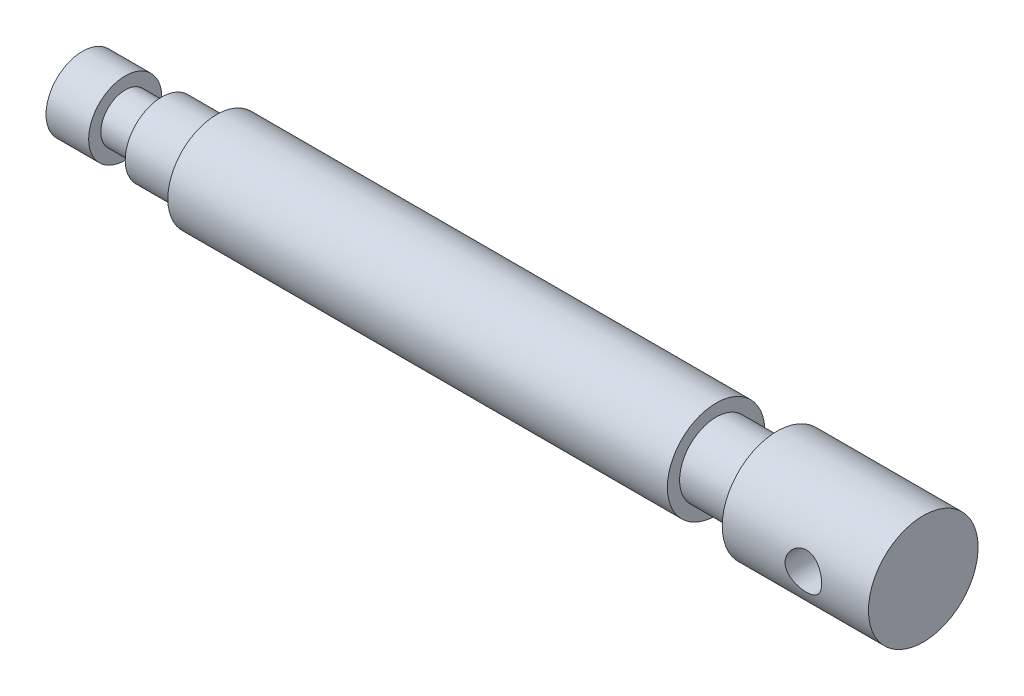
ISO-10303-21;
HEADER;
FILE_DESCRIPTION(('STEP AP214'),'2;1');
FILE_NAME('part.step','',(''),(''),'','','');
FILE_SCHEMA(('AUTOMOTIVE_DESIGN { 1 0 10303 214 1 1 1 1 }'));
ENDSEC;
DATA;
#1=APPLICATION_CONTEXT('core data for automotive mechanical design processes');
#2=APPLICATION_PROTOCOL_DEFINITION('international standard','automotive_design',2000,#1);
#3=PRODUCT_CONTEXT('',#1,'mechanical');
#4=PRODUCT('Part','Part','',(#3));
#5=PRODUCT_RELATED_PRODUCT_CATEGORY('part','',(#4));
#6=PRODUCT_DEFINITION_FORMATION('','',#4);
#7=PRODUCT_DEFINITION_CONTEXT('part definition',#1,'design');
#8=PRODUCT_DEFINITION('design','',#6,#7);
#9=PRODUCT_DEFINITION_SHAPE('','',#8);
#10=(LENGTH_UNIT() NAMED_UNIT(*) SI_UNIT(.MILLI.,.METRE.));
#11=(NAMED_UNIT(*) PLANE_ANGLE_UNIT() SI_UNIT($,.RADIAN.));
#12=(NAMED_UNIT(*) SI_UNIT($,.STERADIAN.) SOLID_ANGLE_UNIT());
#13=UNCERTAINTY_MEASURE_WITH_UNIT(LENGTH_MEASURE(1.E-05),#10,'distance_accuracy_value','');
#14=(GEOMETRIC_REPRESENTATION_CONTEXT(3) GLOBAL_UNCERTAINTY_ASSIGNED_CONTEXT((#13)) GLOBAL_UNIT_ASSIGNED_CONTEXT((#10,
#11,#12)) REPRESENTATION_CONTEXT('',''));
#15=CARTESIAN_POINT('',(0.,0.,0.));
#16=DIRECTION('',(0.,0.,1.));
#17=DIRECTION('',(1.,0.,0.));
#18=AXIS2_PLACEMENT_3D('',#15,#16,#17);
#19=CARTESIAN_POINT('',(22.,0.,0.));
#20=DIRECTION('',(-1.,0.,0.));
#21=DIRECTION('',(0.,0.,1.));
#22=AXIS2_PLACEMENT_3D('',#19,#20,#21);
#23=PLANE('',#22);
#24=CARTESIAN_POINT('',(22.,0.,0.));
#25=DIRECTION('',(-1.,0.,0.));
#26=DIRECTION('',(0.,0.,1.));
#27=AXIS2_PLACEMENT_3D('',#24,#25,#26);
#28=CIRCLE('',#27,8.);
#29=CARTESIAN_POINT('',(22.,0.,8.));
#30=VERTEX_POINT('',#29);
#31=EDGE_CURVE('E77',#30,#30,#28,.T.);
#32=ORIENTED_EDGE('',*,*,#31,.T.);
#33=EDGE_LOOP('',(#32));
#34=FACE_BOUND('',#33,.T.);
#35=CARTESIAN_POINT('',(22.,0.,0.));
#36=DIRECTION('',(-1.,0.,0.));
#37=DIRECTION('',(0.,0.,1.));
#38=AXIS2_PLACEMENT_3D('',#35,#36,#37);
#39=CIRCLE('',#38,6.);
#40=CARTESIAN_POINT('',(22.,0.,6.));
#41=VERTEX_POINT('',#40);
#42=EDGE_CURVE('E10',#41,#41,#39,.T.);
#43=ORIENTED_EDGE('',*,*,#42,.F.);
#44=EDGE_LOOP('',(#43));
#45=FACE_BOUND('',#44,.T.);
#46=ADVANCED_FACE('F33',(#34,#45),#23,.T.);
#47=CARTESIAN_POINT('',(-35.7429371115239,0.,0.));
#48=DIRECTION('',(-1.,0.,0.));
#49=DIRECTION('',(0.,0.,1.));
#50=AXIS2_PLACEMENT_3D('',#47,#48,#49);
#51=CYLINDRICAL_SURFACE('',#50,6.);
#52=ORIENTED_EDGE('',*,*,#42,.T.);
#53=EDGE_LOOP('',(#52));
#54=FACE_BOUND('',#53,.T.);
#55=CARTESIAN_POINT('',(13.,0.,0.));
#56=DIRECTION('',(-1.,0.,0.));
#57=DIRECTION('',(0.,0.,1.));
#58=AXIS2_PLACEMENT_3D('',#55,#56,#57);
#59=CIRCLE('',#58,6.);
#60=CARTESIAN_POINT('',(13.,0.,6.));
#61=VERTEX_POINT('',#60);
#62=EDGE_CURVE('E44',#61,#61,#59,.T.);
#63=ORIENTED_EDGE('',*,*,#62,.F.);
#64=EDGE_LOOP('',(#63));
#65=FACE_BOUND('',#64,.T.);
#66=ADVANCED_FACE('F122',(#54,#65),#51,.T.);
#67=CARTESIAN_POINT('',(13.,0.,0.));
#68=DIRECTION('',(1.,0.,0.));
#69=DIRECTION('',(0.,0.,-1.));
#70=AXIS2_PLACEMENT_3D('',#67,#68,#69);
#71=PLANE('',#70);
#72=CARTESIAN_POINT('',(13.,0.,0.));
#73=DIRECTION('',(-1.,0.,0.));
#74=DIRECTION('',(0.,0.,1.));
#75=AXIS2_PLACEMENT_3D('',#72,#73,#74);
#76=CIRCLE('',#75,4.);
#77=CARTESIAN_POINT('',(13.,0.,4.));
#78=VERTEX_POINT('',#77);
#79=EDGE_CURVE('E48',#78,#78,#76,.T.);
#80=ORIENTED_EDGE('',*,*,#79,.F.);
#81=EDGE_LOOP('',(#80));
#82=FACE_BOUND('',#81,.T.);
#83=ORIENTED_EDGE('',*,*,#62,.T.);
#84=EDGE_LOOP('',(#83));
#85=FACE_BOUND('',#84,.T.);
#86=ADVANCED_FACE('F127',(#82,#85),#71,.F.);
#87=CARTESIAN_POINT('',(-35.7429371115239,0.,0.));
#88=DIRECTION('',(-1.,0.,0.));
#89=DIRECTION('',(0.,0.,1.));
#90=AXIS2_PLACEMENT_3D('',#87,#88,#89);
#91=CYLINDRICAL_SURFACE('',#90,4.);
#92=ORIENTED_EDGE('',*,*,#79,.T.);
#93=EDGE_LOOP('',(#92));
#94=FACE_BOUND('',#93,.T.);
#95=CARTESIAN_POINT('',(7.,0.,0.));
#96=DIRECTION('',(-1.,0.,0.));
#97=DIRECTION('',(0.,0.,1.));
#98=AXIS2_PLACEMENT_3D('',#95,#96,#97);
#99=CIRCLE('',#98,4.);
#100=CARTESIAN_POINT('',(7.,0.,4.));
#101=VERTEX_POINT('',#100);
#102=EDGE_CURVE('E53',#101,#101,#99,.T.);
#103=ORIENTED_EDGE('',*,*,#102,.F.);
#104=EDGE_LOOP('',(#103));
#105=FACE_BOUND('',#104,.T.);
#106=ADVANCED_FACE('F134',(#94,#105),#91,.T.);
#107=CARTESIAN_POINT('',(7.,0.,0.));
#108=DIRECTION('',(1.,0.,0.));
#109=DIRECTION('',(0.,0.,-1.));
#110=AXIS2_PLACEMENT_3D('',#107,#108,#109);
#111=PLANE('',#110);
#112=ORIENTED_EDGE('',*,*,#102,.T.);
#113=EDGE_LOOP('',(#112));
#114=FACE_BOUND('',#113,.T.);
#115=CARTESIAN_POINT('',(7.,0.,0.));
#116=DIRECTION('',(-1.,0.,0.));
#117=DIRECTION('',(0.,0.,1.));
#118=AXIS2_PLACEMENT_3D('',#115,#116,#117);
#119=CIRCLE('',#118,6.);
#120=CARTESIAN_POINT('',(7.,0.,6.));
#121=VERTEX_POINT('',#120);
#122=EDGE_CURVE('E56',#121,#121,#119,.T.);
#123=ORIENTED_EDGE('',*,*,#122,.F.);
#124=EDGE_LOOP('',(#123));
#125=FACE_BOUND('',#124,.T.);
#126=ADVANCED_FACE('F141',(#114,#125),#111,.T.);
#127=CARTESIAN_POINT('',(-35.7429371115239,0.,0.));
#128=DIRECTION('',(-1.,0.,0.));
#129=DIRECTION('',(0.,0.,1.));
#130=AXIS2_PLACEMENT_3D('',#127,#128,#129);
#131=CYLINDRICAL_SURFACE('',#130,6.);
#132=ORIENTED_EDGE('',*,*,#122,.T.);
#133=EDGE_LOOP('',(#132));
#134=FACE_BOUND('',#133,.T.);
#135=CARTESIAN_POINT('',(0.,0.,0.));
#136=DIRECTION('',(-1.,0.,0.));
#137=DIRECTION('',(0.,0.,1.));
#138=AXIS2_PLACEMENT_3D('',#135,#136,#137);
#139=CIRCLE('',#138,6.);
#140=CARTESIAN_POINT('',(0.,0.,6.));
#141=VERTEX_POINT('',#140);
#142=EDGE_CURVE('E59',#141,#141,#139,.T.);
#143=ORIENTED_EDGE('',*,*,#142,.F.);
#144=EDGE_LOOP('',(#143));
#145=FACE_BOUND('',#144,.T.);
#146=ADVANCED_FACE('F145',(#134,#145),#131,.T.);
#147=CARTESIAN_POINT('',(0.,0.,0.));
#148=DIRECTION('',(-1.,0.,0.));
#149=DIRECTION('',(0.,0.,1.));
#150=AXIS2_PLACEMENT_3D('',#147,#148,#149);
#151=PLANE('',#150);
#152=ORIENTED_EDGE('',*,*,#142,.T.);
#153=EDGE_LOOP('',(#152));
#154=FACE_BOUND('',#153,.T.);
#155=ADVANCED_FACE('F149',(#154),#151,.T.);
#156=CARTESIAN_POINT('',(138.,0.,0.));
#157=DIRECTION('',(1.,0.,0.));
#158=DIRECTION('',(0.,0.,-1.));
#159=AXIS2_PLACEMENT_3D('',#156,#157,#158);
#160=PLANE('',#159);
#161=CARTESIAN_POINT('',(138.,0.,0.));
#162=DIRECTION('',(-1.,0.,0.));
#163=DIRECTION('',(0.,0.,1.));
#164=AXIS2_PLACEMENT_3D('',#161,#162,#163);
#165=CIRCLE('',#164,9.);
#166=CARTESIAN_POINT('',(138.,0.,9.));
#167=VERTEX_POINT('',#166);
#168=EDGE_CURVE('E62',#167,#167,#165,.T.);
#169=ORIENTED_EDGE('',*,*,#168,.F.);
#170=EDGE_LOOP('',(#169));
#171=FACE_BOUND('',#170,.T.);
#172=ADVANCED_FACE('F118',(#171),#160,.T.);
#173=CARTESIAN_POINT('',(-35.7429371115239,0.,0.));
#174=DIRECTION('',(-1.,0.,0.));
#175=DIRECTION('',(0.,0.,1.));
#176=AXIS2_PLACEMENT_3D('',#173,#174,#175);
#177=CYLINDRICAL_SURFACE('',#176,9.);
#178=CARTESIAN_POINT('',(130.319310505428,0.,-9.));
#179=CARTESIAN_POINT('',(130.319311266622,-0.163690088660168,-9.00000045902832));
#180=CARTESIAN_POINT('',(130.305869707046,-0.327375583615647,-8.99549308522634));
#181=CARTESIAN_POINT('',(130.252623178976,-0.649925282618914,-8.97795630609842));
#182=CARTESIAN_POINT('',(130.212815473581,-0.808788984356453,-8.96492601606458));
#183=CARTESIAN_POINT('',(130.108352775275,-1.11699836850533,-8.93175923719328));
#184=CARTESIAN_POINT('',(130.04373931805,-1.2663594776581,-8.9116346319256));
#185=CARTESIAN_POINT('',(129.891686986913,-1.55212481041598,-8.86633337152025));
#186=CARTESIAN_POINT('',(129.80424361042,-1.68852647087612,-8.84115572003334));
#187=CARTESIAN_POINT('',(129.605833090851,-1.9492250250668,-8.78742283329015));
#188=CARTESIAN_POINT('',(129.494216802646,-2.07301110089492,-8.75878669391355));
#189=CARTESIAN_POINT('',(129.252009041308,-2.30049807810624,-8.70180944349364));
#190=CARTESIAN_POINT('',(129.121413400642,-2.40419455646839,-8.67346839871647));
#191=CARTESIAN_POINT('',(128.840355159838,-2.59147482668358,-8.61939997431821));
#192=CARTESIAN_POINT('',(128.689429286231,-2.6743945746631,-8.59377117827064));
#193=CARTESIAN_POINT('',(128.374782222052,-2.81345662163316,-8.54925916255803));
#194=CARTESIAN_POINT('',(128.211064953939,-2.86960709216029,-8.53037388482237));
#195=CARTESIAN_POINT('',(127.881290840937,-2.95162038452748,-8.50233909808132));
#196=CARTESIAN_POINT('',(127.71549887996,-2.9784403448153,-8.49288287308834));
#197=CARTESIAN_POINT('',(127.38151924296,-3.00402337000343,-8.48386969888523));
#198=CARTESIAN_POINT('',(127.2133323233,-3.00279510481415,-8.4843096906819));
#199=CARTESIAN_POINT('',(126.887500614095,-2.97305971111025,-8.49477045024541));
#200=CARTESIAN_POINT('',(126.72972529667,-2.94580173950098,-8.50435247602599));
#201=CARTESIAN_POINT('',(126.421130246607,-2.86681848854825,-8.53129973173653));
#202=CARTESIAN_POINT('',(126.270311349122,-2.81509027977561,-8.54866589352323));
#203=CARTESIAN_POINT('',(125.977072256653,-2.68781717418063,-8.58953733393746));
#204=CARTESIAN_POINT('',(125.834826429019,-2.61190214612179,-8.61313697379352));
#205=CARTESIAN_POINT('',(125.564697780588,-2.43866731890942,-8.66377675727179));
#206=CARTESIAN_POINT('',(125.436819124627,-2.34134133709202,-8.6908178937139));
#207=CARTESIAN_POINT('',(125.192035710945,-2.12204799804673,-8.74701987503222));
#208=CARTESIAN_POINT('',(125.0760524219,-1.99905945022895,-8.77621768064528));
#209=CARTESIAN_POINT('',(124.866116705437,-1.7350187099102,-8.8322081516111));
#210=CARTESIAN_POINT('',(124.772166390934,-1.59396478698244,-8.85900058614202));
#211=CARTESIAN_POINT('',(124.608221604722,-1.2958428391388,-8.90751323813381));
#212=CARTESIAN_POINT('',(124.538474031405,-1.138629829249,-8.92918050024118));
#213=CARTESIAN_POINT('',(124.42670098356,-0.813807250093514,-8.96461701433304));
#214=CARTESIAN_POINT('',(124.384665879157,-0.646201314464852,-8.97838900964638));
#215=CARTESIAN_POINT('',(124.33114350736,-0.313151488587903,-8.99602881214321));
#216=CARTESIAN_POINT('',(124.318411077909,-0.14792879959453,-9.00030005501184));
#217=CARTESIAN_POINT('',(124.320308526223,0.182325209880719,-8.99966708084482));
#218=CARTESIAN_POINT('',(124.334933785367,0.347356557958958,-8.99476441258087));
#219=CARTESIAN_POINT('',(124.390146228635,0.667559598912774,-8.97660074151313));
#220=CARTESIAN_POINT('',(124.429969123576,0.822878420504539,-8.96358596133577));
#221=CARTESIAN_POINT('',(124.533490838828,1.12456787573873,-8.9307554049021));
#222=CARTESIAN_POINT('',(124.597192703831,1.27093736552582,-8.91093876140025));
#223=CARTESIAN_POINT('',(124.74852180095,1.55486488917982,-8.86586793861869));
#224=CARTESIAN_POINT('',(124.836734285277,1.69208987765145,-8.84048444267358));
#225=CARTESIAN_POINT('',(125.033892955468,1.95019449040677,-8.78715761748787));
#226=CARTESIAN_POINT('',(125.142845473523,2.07106910338673,-8.75921350781483));
#227=CARTESIAN_POINT('',(125.384246758447,2.2987575234189,-8.70230543941334));
#228=CARTESIAN_POINT('',(125.517538186208,2.40468290773731,-8.67335283262284));
#229=CARTESIAN_POINT('',(125.80062520886,2.59277256697072,-8.61899919884126));
#230=CARTESIAN_POINT('',(125.95042094133,2.67493664379304,-8.59359820146007));
#231=CARTESIAN_POINT('',(126.262329551297,2.81279079124908,-8.54947175374151));
#232=CARTESIAN_POINT('',(126.424416742934,2.86853439649506,-8.53073282378936));
#233=CARTESIAN_POINT('',(126.75644645556,2.95168400027806,-8.50232496919348));
#234=CARTESIAN_POINT('',(126.926385401641,2.97910276486182,-8.49265195870918));
#235=CARTESIAN_POINT('',(127.25990179355,3.00382884743202,-8.48393576622532));
#236=CARTESIAN_POINT('',(127.423357526288,3.00261077192519,-8.48437200772246));
#237=CARTESIAN_POINT('',(127.747605730194,2.97372688034607,-8.49453809471602));
#238=CARTESIAN_POINT('',(127.908398359293,2.94606263837575,-8.50426738708085));
#239=CARTESIAN_POINT('',(128.219717494435,2.86611543938802,-8.53153572914676));
#240=CARTESIAN_POINT('',(128.370380980441,2.81431003804652,-8.54892294067433));
#241=CARTESIAN_POINT('',(128.660992726242,2.68793809727922,-8.58949196455406));
#242=CARTESIAN_POINT('',(128.800938598992,2.6133665056614,-8.6126750629018));
#243=CARTESIAN_POINT('',(129.072761515196,2.43978207775028,-8.66348487678139));
#244=CARTESIAN_POINT('',(129.204020011123,2.33984472829373,-8.69126134926411));
#245=CARTESIAN_POINT('',(129.44837994558,2.11992864940694,-8.74750068849759));
#246=CARTESIAN_POINT('',(129.561476232492,1.99994425335444,-8.77596374737117));
#247=CARTESIAN_POINT('',(129.770743742295,1.73772467076206,-8.83170091576632));
#248=CARTESIAN_POINT('',(129.866083548681,1.59480454049917,-8.8588854540377));
#249=CARTESIAN_POINT('',(130.031281791979,1.29407207221985,-8.90777973517836));
#250=CARTESIAN_POINT('',(130.101146743194,1.13626355439702,-8.9294908772379));
#251=CARTESIAN_POINT('',(130.210475402894,0.81748094160291,-8.96416545205626));
#252=CARTESIAN_POINT('',(130.251157904218,0.656963273029212,-8.97747637267568));
#253=CARTESIAN_POINT('',(130.305571347459,0.330961248030734,-8.99539221192665));
#254=CARTESIAN_POINT('',(130.319309735917,0.165478276706236,-8.99999953595715));
#255=CARTESIAN_POINT('',(130.319310505428,0.,-9.));
#256=B_SPLINE_CURVE_WITH_KNOTS('',3,(#178,#179,#180,#181,#182,#183,#184,#185,#186,#187,#188,
#189,#190,#191,#192,#193,#194,#195,#196,#197,#198,#199,#200,#201,#202,#203,#204,#205,#206,#207,
#208,#209,#210,#211,#212,#213,#214,#215,#216,#217,#218,#219,#220,#221,#222,#223,#224,#225,#226,
#227,#228,#229,#230,#231,#232,#233,#234,#235,#236,#237,#238,#239,#240,#241,#242,#243,#244,#245,
#246,#247,#248,#249,#250,#251,#252,#253,#254,#255),.UNSPECIFIED.,.T.,.F.,(4,2,2,2,2,2,2,2,2,2,2,
2,2,2,2,2,2,2,2,2,2,2,2,2,2,2,2,2,2,2,2,2,2,2,2,2,2,2,4),(0.,0.490461318078029,
0.980973555802563,1.47066801861083,1.96045913339731,2.46554052848268,2.97073299862591,
3.49045154470411,4.01001134078499,4.51205777225523,5.01394901962457,5.49290479653841,
5.97191792566444,6.4586451346539,6.94551307674618,7.45779917434098,7.97013437899854,
8.48755216951072,9.00479006631624,9.49960749525508,9.99434139492528,10.4747447393464,
10.9552093585231,11.4483119953121,11.9415654246567,12.4572306864225,12.9729002470499,
13.4875204148031,14.0019085411752,14.4898699819277,14.9778023805413,15.4564676124125,
15.9352391452793,16.4349020007541,16.9347063337133,17.453989825053,17.9731404345737,
18.4690967512144,18.9649159811442),.UNSPECIFIED.);
#257=CARTESIAN_POINT('',(130.319310505428,0.,-9.));
#258=VERTEX_POINT('',#257);
#259=EDGE_CURVE('E80',#258,#258,#256,.T.);
#260=ORIENTED_EDGE('',*,*,#259,.F.);
#261=EDGE_LOOP('',(#260));
#262=FACE_BOUND('',#261,.T.);
#263=CARTESIAN_POINT('',(130.319310505428,0.,9.));
#264=CARTESIAN_POINT('',(130.319311266622,0.163690088660168,9.00000045902832));
#265=CARTESIAN_POINT('',(130.305869707046,0.327375583615647,8.99549308522634));
#266=CARTESIAN_POINT('',(130.252623178976,0.649925282618914,8.97795630609842));
#267=CARTESIAN_POINT('',(130.212815473581,0.808788984356453,8.96492601606458));
#268=CARTESIAN_POINT('',(130.108352775275,1.11699836850533,8.93175923719328));
#269=CARTESIAN_POINT('',(130.04373931805,1.2663594776581,8.9116346319256));
#270=CARTESIAN_POINT('',(129.891686986913,1.55212481041598,8.86633337152025));
#271=CARTESIAN_POINT('',(129.80424361042,1.68852647087612,8.84115572003334));
#272=CARTESIAN_POINT('',(129.605833090851,1.9492250250668,8.78742283329015));
#273=CARTESIAN_POINT('',(129.494216802646,2.07301110089492,8.75878669391355));
#274=CARTESIAN_POINT('',(129.252009041308,2.30049807810624,8.70180944349364));
#275=CARTESIAN_POINT('',(129.121413400642,2.40419455646839,8.67346839871647));
#276=CARTESIAN_POINT('',(128.840355159838,2.59147482668358,8.61939997431821));
#277=CARTESIAN_POINT('',(128.689429286231,2.6743945746631,8.59377117827064));
#278=CARTESIAN_POINT('',(128.374782222052,2.81345662163316,8.54925916255803));
#279=CARTESIAN_POINT('',(128.211064953939,2.86960709216029,8.53037388482237));
#280=CARTESIAN_POINT('',(127.881290840937,2.95162038452748,8.50233909808132));
#281=CARTESIAN_POINT('',(127.71549887996,2.9784403448153,8.49288287308834));
#282=CARTESIAN_POINT('',(127.38151924296,3.00402337000343,8.48386969888523));
#283=CARTESIAN_POINT('',(127.2133323233,3.00279510481415,8.4843096906819));
#284=CARTESIAN_POINT('',(126.887500614095,2.97305971111025,8.49477045024541));
#285=CARTESIAN_POINT('',(126.72972529667,2.94580173950098,8.50435247602599));
#286=CARTESIAN_POINT('',(126.421130246607,2.86681848854825,8.53129973173653));
#287=CARTESIAN_POINT('',(126.270311349122,2.81509027977561,8.54866589352323));
#288=CARTESIAN_POINT('',(125.977072256653,2.68781717418063,8.58953733393746));
#289=CARTESIAN_POINT('',(125.834826429019,2.61190214612179,8.61313697379352));
#290=CARTESIAN_POINT('',(125.564697780588,2.43866731890942,8.66377675727179));
#291=CARTESIAN_POINT('',(125.436819124627,2.34134133709202,8.6908178937139));
#292=CARTESIAN_POINT('',(125.192035710945,2.12204799804673,8.74701987503222));
#293=CARTESIAN_POINT('',(125.0760524219,1.99905945022895,8.77621768064528));
#294=CARTESIAN_POINT('',(124.866116705437,1.7350187099102,8.8322081516111));
#295=CARTESIAN_POINT('',(124.772166390934,1.59396478698244,8.85900058614202));
#296=CARTESIAN_POINT('',(124.608221604722,1.2958428391388,8.90751323813381));
#297=CARTESIAN_POINT('',(124.538474031405,1.138629829249,8.92918050024118));
#298=CARTESIAN_POINT('',(124.42670098356,0.813807250093514,8.96461701433304));
#299=CARTESIAN_POINT('',(124.384665879157,0.646201314464852,8.97838900964638));
#300=CARTESIAN_POINT('',(124.33114350736,0.313151488587903,8.99602881214321));
#301=CARTESIAN_POINT('',(124.318411077909,0.14792879959453,9.00030005501184));
#302=CARTESIAN_POINT('',(124.320308526223,-0.182325209880719,8.99966708084482));
#303=CARTESIAN_POINT('',(124.334933785367,-0.347356557958958,8.99476441258087));
#304=CARTESIAN_POINT('',(124.390146228635,-0.667559598912774,8.97660074151313));
#305=CARTESIAN_POINT('',(124.429969123576,-0.822878420504539,8.96358596133577));
#306=CARTESIAN_POINT('',(124.533490838828,-1.12456787573873,8.9307554049021));
#307=CARTESIAN_POINT('',(124.597192703831,-1.27093736552582,8.91093876140025));
#308=CARTESIAN_POINT('',(124.74852180095,-1.55486488917982,8.86586793861869));
#309=CARTESIAN_POINT('',(124.836734285277,-1.69208987765145,8.84048444267358));
#310=CARTESIAN_POINT('',(125.033892955468,-1.95019449040677,8.78715761748787));
#311=CARTESIAN_POINT('',(125.142845473523,-2.07106910338673,8.75921350781483));
#312=CARTESIAN_POINT('',(125.384246758447,-2.2987575234189,8.70230543941334));
#313=CARTESIAN_POINT('',(125.517538186208,-2.40468290773731,8.67335283262284));
#314=CARTESIAN_POINT('',(125.80062520886,-2.59277256697072,8.61899919884126));
#315=CARTESIAN_POINT('',(125.95042094133,-2.67493664379304,8.59359820146007));
#316=CARTESIAN_POINT('',(126.262329551297,-2.81279079124908,8.54947175374151));
#317=CARTESIAN_POINT('',(126.424416742934,-2.86853439649506,8.53073282378936));
#318=CARTESIAN_POINT('',(126.75644645556,-2.95168400027806,8.50232496919348));
#319=CARTESIAN_POINT('',(126.926385401641,-2.97910276486182,8.49265195870918));
#320=CARTESIAN_POINT('',(127.25990179355,-3.00382884743202,8.48393576622532));
#321=CARTESIAN_POINT('',(127.423357526288,-3.00261077192519,8.48437200772246));
#322=CARTESIAN_POINT('',(127.747605730194,-2.97372688034607,8.49453809471602));
#323=CARTESIAN_POINT('',(127.908398359293,-2.94606263837575,8.50426738708085));
#324=CARTESIAN_POINT('',(128.219717494435,-2.86611543938802,8.53153572914676));
#325=CARTESIAN_POINT('',(128.370380980441,-2.81431003804652,8.54892294067433));
#326=CARTESIAN_POINT('',(128.660992726242,-2.68793809727922,8.58949196455406));
#327=CARTESIAN_POINT('',(128.800938598992,-2.6133665056614,8.6126750629018));
#328=CARTESIAN_POINT('',(129.072761515196,-2.43978207775028,8.66348487678139));
#329=CARTESIAN_POINT('',(129.204020011123,-2.33984472829373,8.69126134926411));
#330=CARTESIAN_POINT('',(129.44837994558,-2.11992864940694,8.74750068849759));
#331=CARTESIAN_POINT('',(129.561476232492,-1.99994425335444,8.77596374737117));
#332=CARTESIAN_POINT('',(129.770743742295,-1.73772467076206,8.83170091576632));
#333=CARTESIAN_POINT('',(129.866083548681,-1.59480454049917,8.8588854540377));
#334=CARTESIAN_POINT('',(130.031281791979,-1.29407207221985,8.90777973517836));
#335=CARTESIAN_POINT('',(130.101146743194,-1.13626355439702,8.9294908772379));
#336=CARTESIAN_POINT('',(130.210475402894,-0.81748094160291,8.96416545205626));
#337=CARTESIAN_POINT('',(130.251157904218,-0.656963273029212,8.97747637267568));
#338=CARTESIAN_POINT('',(130.305571347459,-0.330961248030734,8.99539221192665));
#339=CARTESIAN_POINT('',(130.319309735917,-0.165478276706236,8.99999953595715));
#340=CARTESIAN_POINT('',(130.319310505428,0.,9.));
#341=B_SPLINE_CURVE_WITH_KNOTS('',3,(#263,#264,#265,#266,#267,#268,#269,#270,#271,#272,#273,
#274,#275,#276,#277,#278,#279,#280,#281,#282,#283,#284,#285,#286,#287,#288,#289,#290,#291,#292,
#293,#294,#295,#296,#297,#298,#299,#300,#301,#302,#303,#304,#305,#306,#307,#308,#309,#310,#311,
#312,#313,#314,#315,#316,#317,#318,#319,#320,#321,#322,#323,#324,#325,#326,#327,#328,#329,#330,
#331,#332,#333,#334,#335,#336,#337,#338,#339,#340),.UNSPECIFIED.,.T.,.F.,(4,2,2,2,2,2,2,2,2,2,2,
2,2,2,2,2,2,2,2,2,2,2,2,2,2,2,2,2,2,2,2,2,2,2,2,2,2,2,4),(0.,0.490461318078029,
0.980973555802563,1.47066801861083,1.96045913339731,2.46554052848268,2.97073299862591,
3.49045154470411,4.01001134078499,4.51205777225523,5.01394901962457,5.49290479653841,
5.97191792566444,6.4586451346539,6.94551307674618,7.45779917434098,7.97013437899854,
8.48755216951072,9.00479006631624,9.49960749525508,9.99434139492528,10.4747447393464,
10.9552093585231,11.4483119953121,11.9415654246567,12.4572306864225,12.9729002470499,
13.4875204148031,14.0019085411752,14.4898699819277,14.9778023805413,15.4564676124125,
15.9352391452793,16.4349020007541,16.9347063337133,17.453989825053,17.9731404345737,
18.4690967512144,18.9649159811442),.UNSPECIFIED.);
#342=CARTESIAN_POINT('',(130.319310505428,0.,9.));
#343=VERTEX_POINT('',#342);
#344=EDGE_CURVE('E86',#343,#343,#341,.T.);
#345=ORIENTED_EDGE('',*,*,#344,.F.);
#346=EDGE_LOOP('',(#345));
#347=FACE_BOUND('',#346,.T.);
#348=ORIENTED_EDGE('',*,*,#168,.T.);
#349=EDGE_LOOP('',(#348));
#350=FACE_BOUND('',#349,.T.);
#351=CARTESIAN_POINT('',(114.,0.,0.));
#352=DIRECTION('',(-1.,0.,0.));
#353=DIRECTION('',(0.,0.,1.));
#354=AXIS2_PLACEMENT_3D('',#351,#352,#353);
#355=CIRCLE('',#354,9.);
#356=CARTESIAN_POINT('',(114.,0.,9.));
#357=VERTEX_POINT('',#356);
#358=EDGE_CURVE('E65',#357,#357,#355,.T.);
#359=ORIENTED_EDGE('',*,*,#358,.F.);
#360=EDGE_LOOP('',(#359));
#361=FACE_BOUND('',#360,.T.);
#362=ADVANCED_FACE('F89',(#262,#347,#350,#361),#177,.T.);
#363=CARTESIAN_POINT('',(114.,-5.27355936696949E-13,0.));
#364=DIRECTION('',(-1.,0.,0.));
#365=DIRECTION('',(0.,0.,1.));
#366=AXIS2_PLACEMENT_3D('',#363,#364,#365);
#367=PLANE('',#366);
#368=ORIENTED_EDGE('',*,*,#358,.T.);
#369=EDGE_LOOP('',(#368));
#370=FACE_BOUND('',#369,.T.);
#371=CARTESIAN_POINT('',(114.,0.,0.));
#372=DIRECTION('',(-1.,0.,0.));
#373=DIRECTION('',(0.,0.,1.));
#374=AXIS2_PLACEMENT_3D('',#371,#372,#373);
#375=CIRCLE('',#374,6.);
#376=CARTESIAN_POINT('',(114.,0.,6.));
#377=VERTEX_POINT('',#376);
#378=EDGE_CURVE('E68',#377,#377,#375,.T.);
#379=ORIENTED_EDGE('',*,*,#378,.F.);
#380=EDGE_LOOP('',(#379));
#381=FACE_BOUND('',#380,.T.);
#382=ADVANCED_FACE('F111',(#370,#381),#367,.T.);
#383=CARTESIAN_POINT('',(-35.7429371115239,0.,0.));
#384=DIRECTION('',(-1.,0.,0.));
#385=DIRECTION('',(0.,0.,1.));
#386=AXIS2_PLACEMENT_3D('',#383,#384,#385);
#387=CYLINDRICAL_SURFACE('',#386,6.);
#388=ORIENTED_EDGE('',*,*,#378,.T.);
#389=EDGE_LOOP('',(#388));
#390=FACE_BOUND('',#389,.T.);
#391=CARTESIAN_POINT('',(104.,0.,0.));
#392=DIRECTION('',(-1.,0.,0.));
#393=DIRECTION('',(0.,0.,1.));
#394=AXIS2_PLACEMENT_3D('',#391,#392,#393);
#395=CIRCLE('',#394,6.);
#396=CARTESIAN_POINT('',(104.,0.,6.));
#397=VERTEX_POINT('',#396);
#398=EDGE_CURVE('E71',#397,#397,#395,.T.);
#399=ORIENTED_EDGE('',*,*,#398,.F.);
#400=EDGE_LOOP('',(#399));
#401=FACE_BOUND('',#400,.T.);
#402=ADVANCED_FACE('F108',(#390,#401),#387,.T.);
#403=CARTESIAN_POINT('',(104.,-4.81096644004234E-13,0.));
#404=DIRECTION('',(1.,0.,0.));
#405=DIRECTION('',(0.,0.,-1.));
#406=AXIS2_PLACEMENT_3D('',#403,#404,#405);
#407=PLANE('',#406);
#408=ORIENTED_EDGE('',*,*,#398,.T.);
#409=EDGE_LOOP('',(#408));
#410=FACE_BOUND('',#409,.T.);
#411=CARTESIAN_POINT('',(104.,0.,0.));
#412=DIRECTION('',(-1.,0.,0.));
#413=DIRECTION('',(0.,0.,1.));
#414=AXIS2_PLACEMENT_3D('',#411,#412,#413);
#415=CIRCLE('',#414,8.);
#416=CARTESIAN_POINT('',(104.,0.,8.));
#417=VERTEX_POINT('',#416);
#418=EDGE_CURVE('E74',#417,#417,#415,.T.);
#419=ORIENTED_EDGE('',*,*,#418,.F.);
#420=EDGE_LOOP('',(#419));
#421=FACE_BOUND('',#420,.T.);
#422=ADVANCED_FACE('F104',(#410,#421),#407,.T.);
#423=CARTESIAN_POINT('',(-35.7429371115239,0.,0.));
#424=DIRECTION('',(-1.,0.,0.));
#425=DIRECTION('',(0.,0.,1.));
#426=AXIS2_PLACEMENT_3D('',#423,#424,#425);
#427=CYLINDRICAL_SURFACE('',#426,8.);
#428=ORIENTED_EDGE('',*,*,#418,.T.);
#429=EDGE_LOOP('',(#428));
#430=FACE_BOUND('',#429,.T.);
#431=ORIENTED_EDGE('',*,*,#31,.F.);
#432=EDGE_LOOP('',(#431));
#433=FACE_BOUND('',#432,.T.);
#434=ADVANCED_FACE('F98',(#430,#433),#427,.T.);
#435=CARTESIAN_POINT('',(127.319310505428,0.,-9.));
#436=DIRECTION('',(0.,0.,1.));
#437=DIRECTION('',(1.,0.,0.));
#438=AXIS2_PLACEMENT_3D('',#435,#436,#437);
#439=CYLINDRICAL_SURFACE('',#438,2.99999999999999);
#440=ORIENTED_EDGE('',*,*,#259,.T.);
#441=EDGE_LOOP('',(#440));
#442=FACE_BOUND('',#441,.T.);
#443=ORIENTED_EDGE('',*,*,#344,.T.);
#444=EDGE_LOOP('',(#443));
#445=FACE_BOUND('',#444,.T.);
#446=CARTESIAN_POINT('',(126.659655252714,2.9265773435136,0.));
#447=CARTESIAN_POINT('',(126.659650837131,2.92657750619089,0.0795740052714432));
#448=CARTESIAN_POINT('',(126.652366137299,2.92496293225891,0.159161563243745));
#449=CARTESIAN_POINT('',(126.624204271875,2.91839381906894,0.315759379057495));
#450=CARTESIAN_POINT('',(126.603310062852,2.91343509159145,0.392766277779108));
#451=CARTESIAN_POINT('',(126.5436585538,2.89819239038064,0.561090149823607));
#452=CARTESIAN_POINT('',(126.501742997985,2.88688765049301,0.651177017635139));
#453=CARTESIAN_POINT('',(126.405540859001,2.85789011586046,0.823395651046476));
#454=CARTESIAN_POINT('',(126.351225506179,2.84018240844958,0.905508273362158));
#455=CARTESIAN_POINT('',(126.250353231745,2.80346230871164,1.04079347185785));
#456=CARTESIAN_POINT('',(126.205629040365,2.78607689004311,1.09581665841293));
#457=CARTESIAN_POINT('',(126.113249866692,2.74734850206025,1.20190388061237));
#458=CARTESIAN_POINT('',(126.065593597614,2.72600378674844,1.25296615540328));
#459=CARTESIAN_POINT('',(125.968469423281,2.67920459765607,1.3513690828977));
#460=CARTESIAN_POINT('',(125.919000847281,2.65374859013421,1.3987083368686));
#461=CARTESIAN_POINT('',(125.819171129211,2.59862186527097,1.48989871303789));
#462=CARTESIAN_POINT('',(125.768809640188,2.56894947672523,1.53374844132534));
#463=CARTESIAN_POINT('',(125.666248493663,2.50423384679792,1.6196081767878));
#464=CARTESIAN_POINT('',(125.614045867568,2.46903961457676,1.66150102887094));
#465=CARTESIAN_POINT('',(125.510317962206,2.39408658893043,1.74191855033156));
#466=CARTESIAN_POINT('',(125.458792897929,2.35432638390494,1.78044217157003));
#467=CARTESIAN_POINT('',(125.306346787047,2.22829587096919,1.89111788146274));
#468=CARTESIAN_POINT('',(125.20744180751,2.13520616955392,1.9584662859441));
#469=CARTESIAN_POINT('',(125.009330757083,1.9203466528864,2.08787673736061));
#470=CARTESIAN_POINT('',(124.911384034635,1.79651433337948,2.14845317924184));
#471=CARTESIAN_POINT('',(124.734079866945,1.53040347148289,2.25470224369754));
#472=CARTESIAN_POINT('',(124.65472384568,1.38812351737015,2.30037372471374));
#473=CARTESIAN_POINT('',(124.522586914177,1.09666125009547,2.37491654918855));
#474=CARTESIAN_POINT('',(124.468680234903,0.948174558165798,2.40451070458336));
#475=CARTESIAN_POINT('',(124.384674888249,0.642642409389242,2.45017027451081));
#476=CARTESIAN_POINT('',(124.354567625214,0.485600064519365,2.46624057360088));
#477=CARTESIAN_POINT('',(124.320667895069,0.176292495705924,2.48430568990167));
#478=CARTESIAN_POINT('',(124.315578780406,0.02420836288608,2.4869941616631));
#479=CARTESIAN_POINT('',(124.328441443394,-0.278690988807912,2.4801617990009));
#480=CARTESIAN_POINT('',(124.346389771228,-0.429506394267924,2.47064279262603));
#481=CARTESIAN_POINT('',(124.403980682373,-0.723104094344425,2.43969350426885));
#482=CARTESIAN_POINT('',(124.443270755858,-0.865976426004544,2.41845668223857));
#483=CARTESIAN_POINT('',(124.541477646862,-1.14243701022336,2.36427614263318));
#484=CARTESIAN_POINT('',(124.600395444427,-1.27602479878687,2.3313318404788));
#485=CARTESIAN_POINT('',(124.736674843048,-1.53352515843477,2.25290705533736));
#486=CARTESIAN_POINT('',(124.814423241494,-1.65715077827581,2.20716003909416));
#487=CARTESIAN_POINT('',(124.984005892116,-1.8886273565286,2.10335537454299));
#488=CARTESIAN_POINT('',(125.075842903759,-1.9964752165263,2.04529531368593));
#489=CARTESIAN_POINT('',(125.223341455819,-2.14761761262627,1.94705679180264));
#490=CARTESIAN_POINT('',(125.275588674004,-2.19733289861273,1.91139450267203));
#491=CARTESIAN_POINT('',(125.38201844921,-2.29171248238627,1.8364652783423));
#492=CARTESIAN_POINT('',(125.436200472176,-2.33637816002848,1.79719933321715));
#493=CARTESIAN_POINT('',(125.545748956566,-2.42059072239039,1.71489692045495));
#494=CARTESIAN_POINT('',(125.601116300817,-2.46013362533522,1.67185756291162));
#495=CARTESIAN_POINT('',(125.712107475021,-2.53403629872841,1.58184881442115));
#496=CARTESIAN_POINT('',(125.767731265867,-2.56839683416634,1.53488000511027));
#497=CARTESIAN_POINT('',(125.870588394217,-2.62758899299171,1.44354940088386));
#498=CARTESIAN_POINT('',(125.917919064394,-2.65308125124345,1.39972417097758));
#499=CARTESIAN_POINT('',(126.011265584378,-2.70032463665794,1.30878659842942));
#500=CARTESIAN_POINT('',(126.057281661509,-2.72207641393907,1.26167482901306));
#501=CARTESIAN_POINT('',(126.147063182603,-2.76192755689663,1.16400933112188));
#502=CARTESIAN_POINT('',(126.19083166505,-2.7800319557247,1.11346047632979));
#503=CARTESIAN_POINT('',(126.275099448453,-2.81276864942132,1.00868221224809));
#504=CARTESIAN_POINT('',(126.315600349486,-2.8274026505744,0.954454628610306));
#505=CARTESIAN_POINT('',(126.403466841711,-2.85726555787262,0.825407588277908));
#506=CARTESIAN_POINT('',(126.449297366706,-2.87137967135401,0.749256608726367));
#507=CARTESIAN_POINT('',(126.529839605949,-2.89456454268129,0.590585983151744));
#508=CARTESIAN_POINT('',(126.564570763947,-2.90364414068191,0.508077791926122));
#509=CARTESIAN_POINT('',(126.614732914395,-2.91618493374985,0.351597189138895));
#510=CARTESIAN_POINT('',(126.632375271887,-2.92031676930352,0.278398820245273));
#511=CARTESIAN_POINT('',(126.655331065209,-2.92562451755224,0.129991767318623));
#512=CARTESIAN_POINT('',(126.660654899628,-2.92680292343275,0.0547848330956989));
#513=CARTESIAN_POINT('',(126.658341724878,-2.92628100530175,-0.0954841217227632));
#514=CARTESIAN_POINT('',(126.650692694071,-2.92457801117068,-0.170545943304118));
#515=CARTESIAN_POINT('',(126.623333491537,-2.91818511475785,-0.318306131132616));
#516=CARTESIAN_POINT('',(126.603611885066,-2.91349238052124,-0.391002187773073));
#517=CARTESIAN_POINT('',(126.546396588128,-2.89891588716947,-0.554476909210777));
#518=CARTESIAN_POINT('',(126.505288200434,-2.88787363617403,-0.643872180841377));
#519=CARTESIAN_POINT('',(126.410786305947,-2.85954608563299,-0.814885576976066));
#520=CARTESIAN_POINT('',(126.357362271684,-2.84224521080264,-0.896483651141028));
#521=CARTESIAN_POINT('',(126.257850626631,-2.80630079267834,-1.03124152929134));
#522=CARTESIAN_POINT('',(126.213577861299,-2.78923166474451,-1.08620209532773));
#523=CARTESIAN_POINT('',(126.122059462348,-2.75118945053121,-1.19219239535704));
#524=CARTESIAN_POINT('',(126.074812495776,-2.73021460545438,-1.24322034374423));
#525=CARTESIAN_POINT('',(125.978459498152,-2.68420784413489,-1.34157977111586));
#526=CARTESIAN_POINT('',(125.929352749285,-2.65917434890181,-1.38890980078714));
#527=CARTESIAN_POINT('',(125.830195656373,-2.60494389974611,-1.48010433275671));
#528=CARTESIAN_POINT('',(125.78014494381,-2.57574528932107,-1.5239674453937));
#529=CARTESIAN_POINT('',(125.678121585327,-2.51201940896988,-1.60990902636064));
#530=CARTESIAN_POINT('',(125.626143889201,-2.47733956613417,-1.65186855544678));
#531=CARTESIAN_POINT('',(125.522802195463,-2.40345636438562,-1.7324391024959));
#532=CARTESIAN_POINT('',(125.47143839212,-2.36425161329343,-1.7710490834684));
#533=CARTESIAN_POINT('',(125.31937450887,-2.23994186361332,-1.882014902663));
#534=CARTESIAN_POINT('',(125.220589923279,-2.14807318863763,-1.94959785424794));
#535=CARTESIAN_POINT('',(125.02188831559,-1.93533252492033,-2.07994829792496));
#536=CARTESIAN_POINT('',(124.923256345279,-1.81230352671738,-2.14116618832552));
#537=CARTESIAN_POINT('',(124.744375630605,-1.54764706997679,-2.24868476416955));
#538=CARTESIAN_POINT('',(124.664128612457,-1.40601786697553,-2.29498404902846));
#539=CARTESIAN_POINT('',(124.530032173822,-1.11547277688872,-2.3707867798115));
#540=CARTESIAN_POINT('',(124.475087607396,-0.967247542954748,-2.40099831205395));
#541=CARTESIAN_POINT('',(124.388976944573,-0.662015394372773,-2.4478583739081));
#542=CARTESIAN_POINT('',(124.35780218811,-0.505011700383473,-2.4645118432856));
#543=CARTESIAN_POINT('',(124.321864638188,-0.195655838270231,-2.48367199294107));
#544=CARTESIAN_POINT('',(124.315789698359,-0.0434981015389665,-2.48688161033729));
#545=CARTESIAN_POINT('',(124.32672911033,0.259734972319729,-2.48107185849107));
#546=CARTESIAN_POINT('',(124.343739904928,0.410810472599675,-2.47205437328132));
#547=CARTESIAN_POINT('',(124.399539847364,0.704966241867517,-2.4420907103859));
#548=CARTESIAN_POINT('',(124.437956707422,0.848138400718023,-2.42134836112432));
#549=CARTESIAN_POINT('',(124.534505849932,1.12534795091587,-2.36815773591158));
#550=CARTESIAN_POINT('',(124.592639071693,1.2593849066871,-2.33570890224652));
#551=CARTESIAN_POINT('',(124.727423023218,1.51783327483302,-2.25830922380704));
#552=CARTESIAN_POINT('',(124.80445051204,1.64197046828335,-2.2131007673705));
#553=CARTESIAN_POINT('',(124.972682194076,1.87455217010874,-2.11043129932062));
#554=CARTESIAN_POINT('',(125.063888989712,1.98299379070251,-2.0529680377808));
#555=CARTESIAN_POINT('',(125.261275838938,2.18763547874703,-1.92205950040066));
#556=CARTESIAN_POINT('',(125.367994999158,2.28287436364267,-1.84792536626425));
#557=CARTESIAN_POINT('',(125.586427081513,2.45280702724626,-1.6847915203777));
#558=CARTESIAN_POINT('',(125.698142909865,2.5274886637288,-1.59578307271377));
#559=CARTESIAN_POINT('',(125.904904175399,2.64798901369169,-1.41375056509902));
#560=CARTESIAN_POINT('',(126.000243659033,2.69628618362574,-1.32271986428699));
#561=CARTESIAN_POINT('',(126.136735024188,2.75754013440221,-1.17565815098668));
#562=CARTESIAN_POINT('',(126.181130348618,2.77608793852357,-1.12490605095799));
#563=CARTESIAN_POINT('',(126.266676163708,2.80963778338709,-1.01965392587335));
#564=CARTESIAN_POINT('',(126.307828264943,2.82464159155393,-0.965155786584774));
#565=CARTESIAN_POINT('',(126.396965790307,2.85518707769803,-0.835739609120725));
#566=CARTESIAN_POINT('',(126.443450012001,2.86961239377377,-0.759497572615622));
#567=CARTESIAN_POINT('',(126.525345011973,2.89334527842346,-0.60055946446721));
#568=CARTESIAN_POINT('',(126.560776045814,2.9026622323758,-0.517875549726484));
#569=CARTESIAN_POINT('',(126.611566601588,2.9154175701501,-0.362939740164006));
#570=CARTESIAN_POINT('',(126.629424541989,2.91962385425905,-0.291581471970276));
#571=CARTESIAN_POINT('',(126.653466503266,2.92520259747913,-0.146818257362255));
#572=CARTESIAN_POINT('',(126.659659326526,2.92657719342769,-0.0734148966353297));
#573=CARTESIAN_POINT('',(126.659655252714,2.9265773435136,0.));
#574=B_SPLINE_CURVE_WITH_KNOTS('',3,(#446,#447,#448,#449,#450,#451,#452,#453,#454,#455,#456,
#457,#458,#459,#460,#461,#462,#463,#464,#465,#466,#467,#468,#469,#470,#471,#472,#473,#474,#475,
#476,#477,#478,#479,#480,#481,#482,#483,#484,#485,#486,#487,#488,#489,#490,#491,#492,#493,#494,
#495,#496,#497,#498,#499,#500,#501,#502,#503,#504,#505,#506,#507,#508,#509,#510,#511,#512,#513,
#514,#515,#516,#517,#518,#519,#520,#521,#522,#523,#524,#525,#526,#527,#528,#529,#530,#531,#532,
#533,#534,#535,#536,#537,#538,#539,#540,#541,#542,#543,#544,#545,#546,#547,#548,#549,#550,#551,
#552,#553,#554,#555,#556,#557,#558,#559,#560,#561,#562,#563,#564,#565,#566,#567,#568,#569,#570,
#571,#572,#573),.UNSPECIFIED.,.T.,.F.,(4,2,2,2,2,2,2,2,2,2,2,2,2,2,2,2,2,2,2,2,2,2,2,2,2,2,2,2,
2,2,2,2,2,2,2,2,2,2,2,2,2,2,2,2,2,2,2,2,2,2,2,2,2,2,2,2,2,2,2,2,2,2,2,4),(0.,0.23842073046933,
0.477140615060968,0.775488069089534,1.07453490500069,1.29328552811696,1.51213284769727,
1.73106199892081,1.95007816818856,2.17671739949951,2.40342688740147,2.85636736181793,
3.36111181477043,3.86589491660348,4.34556321132625,4.82505818461733,5.27941893443318,
5.73371165245567,6.180719224889,6.62774912049388,7.08488359946036,7.54210772968852,
7.78325691543308,8.0243400446952,8.2656094503054,8.50684320626311,8.71474343712997,
8.92260749706836,9.13018272282999,9.33765567785191,9.60676420988612,9.87539870302636,
10.1006402468038,10.325691585145,10.5509515870342,10.7764252785778,11.071820123894,
11.3679552072487,11.5855116083183,11.8031662159473,12.0209057047222,12.2387320330737,
12.4643047893099,12.6899471334992,13.1407573908428,13.6456338410874,14.1505576762084,
14.6308943295998,15.1110558979662,15.565771350573,16.0204167455823,16.4673913423853,
16.9143872365195,17.3711473504141,17.8279913956928,18.3091974547514,18.7906871332735,
19.2101690193007,19.4197522304837,19.6292306987882,19.89972730523,20.1697252599798,
20.3898581611012,20.6098248854532),.UNSPECIFIED.);
#575=CARTESIAN_POINT('',(126.659655252714,2.9265773435136,0.));
#576=VERTEX_POINT('',#575);
#577=EDGE_CURVE('E36',#576,#576,#574,.T.);
#578=ORIENTED_EDGE('',*,*,#577,.F.);
#579=EDGE_LOOP('',(#578));
#580=FACE_BOUND('',#579,.T.);
#581=ADVANCED_FACE('F93',(#442,#445,#580),#439,.F.);
#582=CARTESIAN_POINT('',(126.,0.,0.));
#583=DIRECTION('',(-1.,0.,0.));
#584=DIRECTION('',(0.,1.,0.));
#585=AXIS2_PLACEMENT_3D('',#582,#583,#584);
#586=SPHERICAL_SURFACE('',#585,3.);
#587=ORIENTED_EDGE('',*,*,#577,.T.);
#588=EDGE_LOOP('',(#587));
#589=FACE_BOUND('',#588,.T.);
#590=ADVANCED_FACE('F97',(#589),#586,.F.);
#591=CLOSED_SHELL('',(#46,#66,#86,#106,#126,#146,#155,#172,#362,#382,#402,#422,#434,#581,#590));
#592=MANIFOLD_SOLID_BREP('B2',#591);
#593=ADVANCED_BREP_SHAPE_REPRESENTATION('',(#18,#592),#14);
#594=SHAPE_DEFINITION_REPRESENTATION(#9,#593);
ENDSEC;
END-ISO-10303-21;
